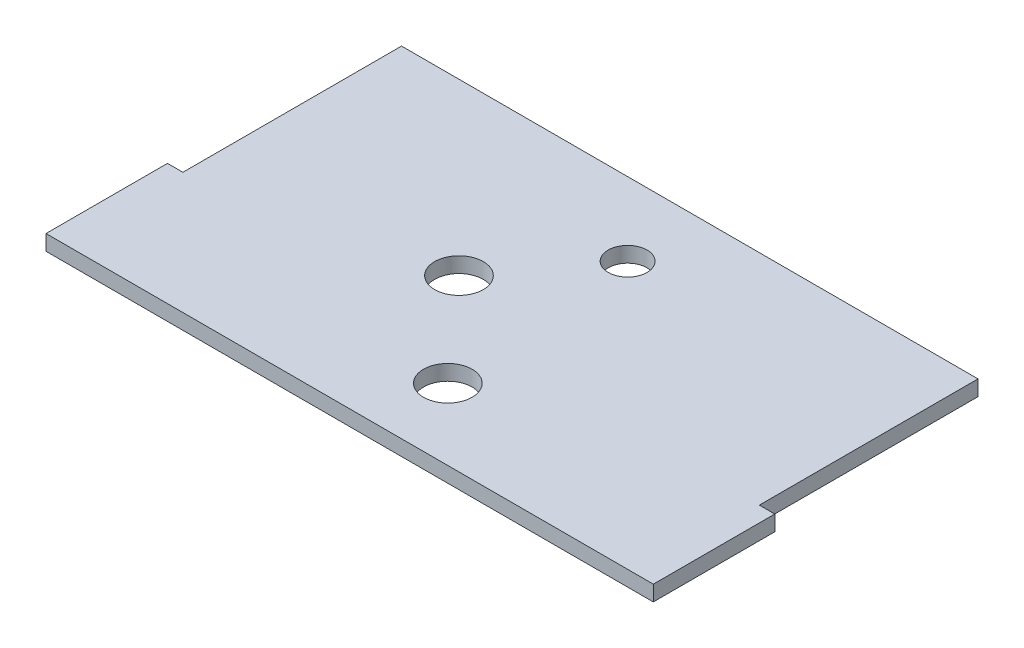
ISO-10303-21;
HEADER;
FILE_DESCRIPTION(('STEP AP214'),'2;1');
FILE_NAME('part.step','',(''),(''),'','','');
FILE_SCHEMA(('AUTOMOTIVE_DESIGN { 1 0 10303 214 1 1 1 1 }'));
ENDSEC;
DATA;
#1=APPLICATION_CONTEXT('core data for automotive mechanical design processes');
#2=APPLICATION_PROTOCOL_DEFINITION('international standard','automotive_design',2000,#1);
#3=PRODUCT_CONTEXT('',#1,'mechanical');
#4=PRODUCT('Part','Part','',(#3));
#5=PRODUCT_RELATED_PRODUCT_CATEGORY('part','',(#4));
#6=PRODUCT_DEFINITION_FORMATION('','',#4);
#7=PRODUCT_DEFINITION_CONTEXT('part definition',#1,'design');
#8=PRODUCT_DEFINITION('design','',#6,#7);
#9=PRODUCT_DEFINITION_SHAPE('','',#8);
#10=(LENGTH_UNIT() NAMED_UNIT(*) SI_UNIT(.MILLI.,.METRE.));
#11=(NAMED_UNIT(*) PLANE_ANGLE_UNIT() SI_UNIT($,.RADIAN.));
#12=(NAMED_UNIT(*) SI_UNIT($,.STERADIAN.) SOLID_ANGLE_UNIT());
#13=UNCERTAINTY_MEASURE_WITH_UNIT(LENGTH_MEASURE(1.E-05),#10,'distance_accuracy_value','');
#14=(GEOMETRIC_REPRESENTATION_CONTEXT(3) GLOBAL_UNCERTAINTY_ASSIGNED_CONTEXT((#13)) GLOBAL_UNIT_ASSIGNED_CONTEXT((#10,
#11,#12)) REPRESENTATION_CONTEXT('',''));
#15=CARTESIAN_POINT('',(0.,0.,0.));
#16=DIRECTION('',(0.,0.,1.));
#17=DIRECTION('',(1.,0.,0.));
#18=AXIS2_PLACEMENT_3D('',#15,#16,#17);
#19=CARTESIAN_POINT('',(62.5,3.175,-35.));
#20=DIRECTION('',(-1.,0.,0.));
#21=DIRECTION('',(0.,0.,1.));
#22=AXIS2_PLACEMENT_3D('',#19,#20,#21);
#23=PLANE('',#22);
#24=DIRECTION('',(0.,0.,-1.));
#25=VECTOR('',#24,1.);
#26=CARTESIAN_POINT('',(62.5,0.,-35.));
#27=LINE('',#26,#25);
#28=CARTESIAN_POINT('',(62.5,0.,35.));
#29=VERTEX_POINT('',#28);
#30=CARTESIAN_POINT('',(62.5,0.,9.99999999999999));
#31=VERTEX_POINT('',#30);
#32=EDGE_CURVE('E129',#29,#31,#27,.T.);
#33=ORIENTED_EDGE('',*,*,#32,.T.);
#34=DIRECTION('',(0.,1.,0.));
#35=VECTOR('',#34,1.);
#36=CARTESIAN_POINT('',(62.5,0.,9.99999999999999));
#37=LINE('',#36,#35);
#38=CARTESIAN_POINT('',(62.5,3.175,9.99999999999999));
#39=VERTEX_POINT('',#38);
#40=EDGE_CURVE('E185',#31,#39,#37,.T.);
#41=ORIENTED_EDGE('',*,*,#40,.T.);
#42=DIRECTION('',(0.,0.,-1.));
#43=VECTOR('',#42,1.);
#44=CARTESIAN_POINT('',(62.5,3.175,-35.));
#45=LINE('',#44,#43);
#46=CARTESIAN_POINT('',(62.5,3.175,35.));
#47=VERTEX_POINT('',#46);
#48=EDGE_CURVE('E126',#47,#39,#45,.T.);
#49=ORIENTED_EDGE('',*,*,#48,.F.);
#50=DIRECTION('',(0.,-1.,0.));
#51=VECTOR('',#50,1.);
#52=CARTESIAN_POINT('',(62.5,3.175,35.));
#53=LINE('',#52,#51);
#54=EDGE_CURVE('E46',#47,#29,#53,.T.);
#55=ORIENTED_EDGE('',*,*,#54,.T.);
#56=EDGE_LOOP('',(#33,#41,#49,#55));
#57=FACE_BOUND('',#56,.T.);
#58=ADVANCED_FACE('F39',(#57),#23,.F.);
#59=CARTESIAN_POINT('',(-62.5,3.175,-35.));
#60=DIRECTION('',(0.,0.,1.));
#61=DIRECTION('',(1.,0.,0.));
#62=AXIS2_PLACEMENT_3D('',#59,#60,#61);
#63=PLANE('',#62);
#64=DIRECTION('',(-1.,0.,0.));
#65=VECTOR('',#64,1.);
#66=CARTESIAN_POINT('',(-62.5,0.,-35.));
#67=LINE('',#66,#65);
#68=CARTESIAN_POINT('',(59.325,0.,-35.));
#69=VERTEX_POINT('',#68);
#70=CARTESIAN_POINT('',(-59.325,0.,-35.));
#71=VERTEX_POINT('',#70);
#72=EDGE_CURVE('E124',#69,#71,#67,.T.);
#73=ORIENTED_EDGE('',*,*,#72,.T.);
#74=DIRECTION('',(0.,1.,0.));
#75=VECTOR('',#74,1.);
#76=CARTESIAN_POINT('',(-59.325,0.,-35.));
#77=LINE('',#76,#75);
#78=CARTESIAN_POINT('',(-59.325,3.175,-35.));
#79=VERTEX_POINT('',#78);
#80=EDGE_CURVE('E172',#71,#79,#77,.T.);
#81=ORIENTED_EDGE('',*,*,#80,.T.);
#82=DIRECTION('',(-1.,0.,0.));
#83=VECTOR('',#82,1.);
#84=CARTESIAN_POINT('',(-62.5,3.175,-35.));
#85=LINE('',#84,#83);
#86=CARTESIAN_POINT('',(59.325,3.175,-35.));
#87=VERTEX_POINT('',#86);
#88=EDGE_CURVE('E142',#87,#79,#85,.T.);
#89=ORIENTED_EDGE('',*,*,#88,.F.);
#90=DIRECTION('',(0.,1.,0.));
#91=VECTOR('',#90,1.);
#92=CARTESIAN_POINT('',(59.325,0.,-35.));
#93=LINE('',#92,#91);
#94=EDGE_CURVE('E170',#69,#87,#93,.T.);
#95=ORIENTED_EDGE('',*,*,#94,.F.);
#96=EDGE_LOOP('',(#73,#81,#89,#95));
#97=FACE_BOUND('',#96,.T.);
#98=ADVANCED_FACE('F169',(#97),#63,.F.);
#99=CARTESIAN_POINT('',(-62.5,3.175,-35.));
#100=DIRECTION('',(1.,0.,0.));
#101=DIRECTION('',(0.,0.,-1.));
#102=AXIS2_PLACEMENT_3D('',#99,#100,#101);
#103=PLANE('',#102);
#104=DIRECTION('',(0.,0.,1.));
#105=VECTOR('',#104,1.);
#106=CARTESIAN_POINT('',(-62.5,3.175,-35.));
#107=LINE('',#106,#105);
#108=CARTESIAN_POINT('',(-62.5,3.175,10.));
#109=VERTEX_POINT('',#108);
#110=CARTESIAN_POINT('',(-62.5,3.175,35.));
#111=VERTEX_POINT('',#110);
#112=EDGE_CURVE('E118',#109,#111,#107,.T.);
#113=ORIENTED_EDGE('',*,*,#112,.F.);
#114=DIRECTION('',(0.,1.,0.));
#115=VECTOR('',#114,1.);
#116=CARTESIAN_POINT('',(-62.5,0.,10.));
#117=LINE('',#116,#115);
#118=CARTESIAN_POINT('',(-62.5,0.,10.));
#119=VERTEX_POINT('',#118);
#120=EDGE_CURVE('E106',#119,#109,#117,.T.);
#121=ORIENTED_EDGE('',*,*,#120,.F.);
#122=DIRECTION('',(0.,0.,1.));
#123=VECTOR('',#122,1.);
#124=CARTESIAN_POINT('',(-62.5,0.,-35.));
#125=LINE('',#124,#123);
#126=CARTESIAN_POINT('',(-62.5,0.,35.));
#127=VERTEX_POINT('',#126);
#128=EDGE_CURVE('E117',#119,#127,#125,.T.);
#129=ORIENTED_EDGE('',*,*,#128,.T.);
#130=DIRECTION('',(0.,-1.,0.));
#131=VECTOR('',#130,1.);
#132=CARTESIAN_POINT('',(-62.5,3.175,35.));
#133=LINE('',#132,#131);
#134=EDGE_CURVE('E11',#111,#127,#133,.T.);
#135=ORIENTED_EDGE('',*,*,#134,.F.);
#136=EDGE_LOOP('',(#113,#121,#129,#135));
#137=FACE_BOUND('',#136,.T.);
#138=ADVANCED_FACE('F115',(#137),#103,.F.);
#139=CARTESIAN_POINT('',(-62.5,3.175,35.));
#140=DIRECTION('',(0.,0.,-1.));
#141=DIRECTION('',(-1.,0.,0.));
#142=AXIS2_PLACEMENT_3D('',#139,#140,#141);
#143=PLANE('',#142);
#144=DIRECTION('',(1.,0.,0.));
#145=VECTOR('',#144,1.);
#146=CARTESIAN_POINT('',(-62.5,0.,35.));
#147=LINE('',#146,#145);
#148=EDGE_CURVE('E123',#127,#29,#147,.T.);
#149=ORIENTED_EDGE('',*,*,#148,.T.);
#150=ORIENTED_EDGE('',*,*,#54,.F.);
#151=DIRECTION('',(1.,0.,0.));
#152=VECTOR('',#151,1.);
#153=CARTESIAN_POINT('',(-62.5,3.175,35.));
#154=LINE('',#153,#152);
#155=EDGE_CURVE('E133',#111,#47,#154,.T.);
#156=ORIENTED_EDGE('',*,*,#155,.F.);
#157=ORIENTED_EDGE('',*,*,#134,.T.);
#158=EDGE_LOOP('',(#149,#150,#156,#157));
#159=FACE_BOUND('',#158,.T.);
#160=ADVANCED_FACE('F213',(#159),#143,.F.);
#161=CARTESIAN_POINT('',(0.,3.175,0.));
#162=DIRECTION('',(0.,1.,0.));
#163=DIRECTION('',(0.,0.,1.));
#164=AXIS2_PLACEMENT_3D('',#161,#162,#163);
#165=PLANE('',#164);
#166=DIRECTION('',(0.,0.,-1.));
#167=VECTOR('',#166,1.);
#168=CARTESIAN_POINT('',(-59.325,3.175,-35.));
#169=LINE('',#168,#167);
#170=CARTESIAN_POINT('',(-59.325,3.175,10.));
#171=VERTEX_POINT('',#170);
#172=EDGE_CURVE('E111',#171,#79,#169,.T.);
#173=ORIENTED_EDGE('',*,*,#172,.F.);
#174=DIRECTION('',(1.,0.,0.));
#175=VECTOR('',#174,1.);
#176=CARTESIAN_POINT('',(-62.5,3.175,10.));
#177=LINE('',#176,#175);
#178=EDGE_CURVE('E191',#109,#171,#177,.T.);
#179=ORIENTED_EDGE('',*,*,#178,.F.);
#180=ORIENTED_EDGE('',*,*,#112,.T.);
#181=ORIENTED_EDGE('',*,*,#155,.T.);
#182=ORIENTED_EDGE('',*,*,#48,.T.);
#183=DIRECTION('',(1.,0.,0.));
#184=VECTOR('',#183,1.);
#185=CARTESIAN_POINT('',(62.5,3.175,9.99999999999999));
#186=LINE('',#185,#184);
#187=CARTESIAN_POINT('',(59.325,3.175,9.99999999999999));
#188=VERTEX_POINT('',#187);
#189=EDGE_CURVE('E187',#188,#39,#186,.T.);
#190=ORIENTED_EDGE('',*,*,#189,.F.);
#191=DIRECTION('',(0.,0.,1.));
#192=VECTOR('',#191,1.);
#193=CARTESIAN_POINT('',(59.325,3.175,9.99999999999999));
#194=LINE('',#193,#192);
#195=EDGE_CURVE('E165',#87,#188,#194,.T.);
#196=ORIENTED_EDGE('',*,*,#195,.F.);
#197=ORIENTED_EDGE('',*,*,#88,.T.);
#198=EDGE_LOOP('',(#173,#179,#180,#181,#182,#190,#196,#197));
#199=FACE_BOUND('',#198,.T.);
#200=CARTESIAN_POINT('',(2.30016070902177,3.175,-19.9121651419793));
#201=DIRECTION('',(0.,1.,0.));
#202=DIRECTION('',(0.,0.,1.));
#203=AXIS2_PLACEMENT_3D('',#200,#201,#202);
#204=CIRCLE('',#203,4.);
#205=CARTESIAN_POINT('',(2.30016070902177,3.175,-15.9121651419793));
#206=VERTEX_POINT('',#205);
#207=EDGE_CURVE('E173',#206,#206,#204,.T.);
#208=ORIENTED_EDGE('',*,*,#207,.F.);
#209=EDGE_LOOP('',(#208));
#210=FACE_BOUND('',#209,.T.);
#211=CARTESIAN_POINT('',(-12.5,3.175,0.));
#212=DIRECTION('',(0.,1.,0.));
#213=DIRECTION('',(0.,0.,1.));
#214=AXIS2_PLACEMENT_3D('',#211,#212,#213);
#215=CIRCLE('',#214,5.);
#216=CARTESIAN_POINT('',(-12.5,3.175,4.99999999999999));
#217=VERTEX_POINT('',#216);
#218=EDGE_CURVE('E197',#217,#217,#215,.T.);
#219=ORIENTED_EDGE('',*,*,#218,.F.);
#220=EDGE_LOOP('',(#219));
#221=FACE_BOUND('',#220,.T.);
#222=CARTESIAN_POINT('',(5.54408165707277,3.175,20.339852314619));
#223=DIRECTION('',(0.,1.,0.));
#224=DIRECTION('',(0.,0.,1.));
#225=AXIS2_PLACEMENT_3D('',#222,#223,#224);
#226=CIRCLE('',#225,5.);
#227=CARTESIAN_POINT('',(5.54408165707277,3.175,25.339852314619));
#228=VERTEX_POINT('',#227);
#229=EDGE_CURVE('E148',#228,#228,#226,.T.);
#230=ORIENTED_EDGE('',*,*,#229,.F.);
#231=EDGE_LOOP('',(#230));
#232=FACE_BOUND('',#231,.T.);
#233=ADVANCED_FACE('F161',(#199,#210,#221,#232),#165,.T.);
#234=CARTESIAN_POINT('',(0.,0.,0.));
#235=DIRECTION('',(0.,1.,0.));
#236=DIRECTION('',(0.,0.,1.));
#237=AXIS2_PLACEMENT_3D('',#234,#235,#236);
#238=PLANE('',#237);
#239=CARTESIAN_POINT('',(2.30016070902177,0.,-19.9121651419793));
#240=DIRECTION('',(0.,1.,0.));
#241=DIRECTION('',(0.,0.,1.));
#242=AXIS2_PLACEMENT_3D('',#239,#240,#241);
#243=CIRCLE('',#242,4.);
#244=CARTESIAN_POINT('',(2.30016070902177,0.,-15.9121651419793));
#245=VERTEX_POINT('',#244);
#246=EDGE_CURVE('E176',#245,#245,#243,.T.);
#247=ORIENTED_EDGE('',*,*,#246,.T.);
#248=EDGE_LOOP('',(#247));
#249=FACE_BOUND('',#248,.T.);
#250=CARTESIAN_POINT('',(-12.5,0.,0.));
#251=DIRECTION('',(0.,1.,0.));
#252=DIRECTION('',(0.,0.,1.));
#253=AXIS2_PLACEMENT_3D('',#250,#251,#252);
#254=CIRCLE('',#253,5.);
#255=CARTESIAN_POINT('',(-12.5,0.,4.99999999999999));
#256=VERTEX_POINT('',#255);
#257=EDGE_CURVE('E153',#256,#256,#254,.T.);
#258=ORIENTED_EDGE('',*,*,#257,.T.);
#259=EDGE_LOOP('',(#258));
#260=FACE_BOUND('',#259,.T.);
#261=CARTESIAN_POINT('',(5.54408165707277,0.,20.339852314619));
#262=DIRECTION('',(0.,1.,0.));
#263=DIRECTION('',(0.,0.,1.));
#264=AXIS2_PLACEMENT_3D('',#261,#262,#263);
#265=CIRCLE('',#264,5.);
#266=CARTESIAN_POINT('',(5.54408165707277,0.,25.339852314619));
#267=VERTEX_POINT('',#266);
#268=EDGE_CURVE('E145',#267,#267,#265,.T.);
#269=ORIENTED_EDGE('',*,*,#268,.T.);
#270=EDGE_LOOP('',(#269));
#271=FACE_BOUND('',#270,.T.);
#272=DIRECTION('',(1.,0.,0.));
#273=VECTOR('',#272,1.);
#274=CARTESIAN_POINT('',(-62.5,0.,10.));
#275=LINE('',#274,#273);
#276=CARTESIAN_POINT('',(-59.325,0.,10.));
#277=VERTEX_POINT('',#276);
#278=EDGE_CURVE('E102',#119,#277,#275,.T.);
#279=ORIENTED_EDGE('',*,*,#278,.T.);
#280=DIRECTION('',(0.,0.,-1.));
#281=VECTOR('',#280,1.);
#282=CARTESIAN_POINT('',(-59.325,0.,-10.));
#283=LINE('',#282,#281);
#284=EDGE_CURVE('E53',#277,#71,#283,.T.);
#285=ORIENTED_EDGE('',*,*,#284,.T.);
#286=ORIENTED_EDGE('',*,*,#72,.F.);
#287=DIRECTION('',(0.,0.,1.));
#288=VECTOR('',#287,1.);
#289=CARTESIAN_POINT('',(59.325,0.,-35.));
#290=LINE('',#289,#288);
#291=CARTESIAN_POINT('',(59.325,0.,9.99999999999999));
#292=VERTEX_POINT('',#291);
#293=EDGE_CURVE('E189',#69,#292,#290,.T.);
#294=ORIENTED_EDGE('',*,*,#293,.T.);
#295=DIRECTION('',(1.,0.,0.));
#296=VECTOR('',#295,1.);
#297=CARTESIAN_POINT('',(62.5,0.,9.99999999999999));
#298=LINE('',#297,#296);
#299=EDGE_CURVE('E61',#292,#31,#298,.T.);
#300=ORIENTED_EDGE('',*,*,#299,.T.);
#301=ORIENTED_EDGE('',*,*,#32,.F.);
#302=ORIENTED_EDGE('',*,*,#148,.F.);
#303=ORIENTED_EDGE('',*,*,#128,.F.);
#304=EDGE_LOOP('',(#279,#285,#286,#294,#300,#301,#302,#303));
#305=FACE_BOUND('',#304,.T.);
#306=ADVANCED_FACE('F121',(#249,#260,#271,#305),#238,.F.);
#307=CARTESIAN_POINT('',(5.54408165707277,3.175,20.339852314619));
#308=DIRECTION('',(0.,1.,0.));
#309=DIRECTION('',(0.,0.,1.));
#310=AXIS2_PLACEMENT_3D('',#307,#308,#309);
#311=CYLINDRICAL_SURFACE('',#310,5.);
#312=ORIENTED_EDGE('',*,*,#268,.F.);
#313=EDGE_LOOP('',(#312));
#314=FACE_BOUND('',#313,.T.);
#315=ORIENTED_EDGE('',*,*,#229,.T.);
#316=EDGE_LOOP('',(#315));
#317=FACE_BOUND('',#316,.T.);
#318=ADVANCED_FACE('F207',(#314,#317),#311,.F.);
#319=CARTESIAN_POINT('',(-12.5,3.175,0.));
#320=DIRECTION('',(0.,1.,0.));
#321=DIRECTION('',(0.,0.,1.));
#322=AXIS2_PLACEMENT_3D('',#319,#320,#321);
#323=CYLINDRICAL_SURFACE('',#322,5.);
#324=ORIENTED_EDGE('',*,*,#257,.F.);
#325=EDGE_LOOP('',(#324));
#326=FACE_BOUND('',#325,.T.);
#327=ORIENTED_EDGE('',*,*,#218,.T.);
#328=EDGE_LOOP('',(#327));
#329=FACE_BOUND('',#328,.T.);
#330=ADVANCED_FACE('F203',(#326,#329),#323,.F.);
#331=CARTESIAN_POINT('',(2.30016070902177,3.175,-19.9121651419793));
#332=DIRECTION('',(0.,1.,0.));
#333=DIRECTION('',(0.,0.,1.));
#334=AXIS2_PLACEMENT_3D('',#331,#332,#333);
#335=CYLINDRICAL_SURFACE('',#334,4.);
#336=ORIENTED_EDGE('',*,*,#246,.F.);
#337=EDGE_LOOP('',(#336));
#338=FACE_BOUND('',#337,.T.);
#339=ORIENTED_EDGE('',*,*,#207,.T.);
#340=EDGE_LOOP('',(#339));
#341=FACE_BOUND('',#340,.T.);
#342=ADVANCED_FACE('F206',(#338,#341),#335,.F.);
#343=CARTESIAN_POINT('',(62.5,0.,9.99999999999999));
#344=DIRECTION('',(0.,0.,1.));
#345=DIRECTION('',(1.,0.,0.));
#346=AXIS2_PLACEMENT_3D('',#343,#344,#345);
#347=PLANE('',#346);
#348=ORIENTED_EDGE('',*,*,#189,.T.);
#349=ORIENTED_EDGE('',*,*,#40,.F.);
#350=ORIENTED_EDGE('',*,*,#299,.F.);
#351=DIRECTION('',(0.,1.,0.));
#352=VECTOR('',#351,1.);
#353=CARTESIAN_POINT('',(59.325,0.,9.99999999999999));
#354=LINE('',#353,#352);
#355=EDGE_CURVE('E183',#292,#188,#354,.T.);
#356=ORIENTED_EDGE('',*,*,#355,.T.);
#357=EDGE_LOOP('',(#348,#349,#350,#356));
#358=FACE_BOUND('',#357,.T.);
#359=ADVANCED_FACE('F238',(#358),#347,.F.);
#360=CARTESIAN_POINT('',(59.325,0.,9.99999999999999));
#361=DIRECTION('',(-1.,0.,0.));
#362=DIRECTION('',(0.,0.,1.));
#363=AXIS2_PLACEMENT_3D('',#360,#361,#362);
#364=PLANE('',#363);
#365=ORIENTED_EDGE('',*,*,#195,.T.);
#366=ORIENTED_EDGE('',*,*,#355,.F.);
#367=ORIENTED_EDGE('',*,*,#293,.F.);
#368=ORIENTED_EDGE('',*,*,#94,.T.);
#369=EDGE_LOOP('',(#365,#366,#367,#368));
#370=FACE_BOUND('',#369,.T.);
#371=ADVANCED_FACE('F240',(#370),#364,.F.);
#372=CARTESIAN_POINT('',(-59.325,0.,-35.));
#373=DIRECTION('',(1.,0.,0.));
#374=DIRECTION('',(0.,0.,-1.));
#375=AXIS2_PLACEMENT_3D('',#372,#373,#374);
#376=PLANE('',#375);
#377=ORIENTED_EDGE('',*,*,#172,.T.);
#378=ORIENTED_EDGE('',*,*,#80,.F.);
#379=ORIENTED_EDGE('',*,*,#284,.F.);
#380=DIRECTION('',(0.,1.,0.));
#381=VECTOR('',#380,1.);
#382=CARTESIAN_POINT('',(-59.325,0.,10.));
#383=LINE('',#382,#381);
#384=EDGE_CURVE('E108',#277,#171,#383,.T.);
#385=ORIENTED_EDGE('',*,*,#384,.T.);
#386=EDGE_LOOP('',(#377,#378,#379,#385));
#387=FACE_BOUND('',#386,.T.);
#388=ADVANCED_FACE('F242',(#387),#376,.F.);
#389=CARTESIAN_POINT('',(-62.5,0.,10.));
#390=DIRECTION('',(0.,0.,1.));
#391=DIRECTION('',(1.,0.,0.));
#392=AXIS2_PLACEMENT_3D('',#389,#390,#391);
#393=PLANE('',#392);
#394=ORIENTED_EDGE('',*,*,#178,.T.);
#395=ORIENTED_EDGE('',*,*,#384,.F.);
#396=ORIENTED_EDGE('',*,*,#278,.F.);
#397=ORIENTED_EDGE('',*,*,#120,.T.);
#398=EDGE_LOOP('',(#394,#395,#396,#397));
#399=FACE_BOUND('',#398,.T.);
#400=ADVANCED_FACE('F105',(#399),#393,.F.);
#401=CLOSED_SHELL('',(#58,#98,#138,#160,#233,#306,#318,#330,#342,#359,#371,#388,#400));
#402=MANIFOLD_SOLID_BREP('B2',#401);
#403=ADVANCED_BREP_SHAPE_REPRESENTATION('',(#18,#402),#14);
#404=SHAPE_DEFINITION_REPRESENTATION(#9,#403);
ENDSEC;
END-ISO-10303-21;
